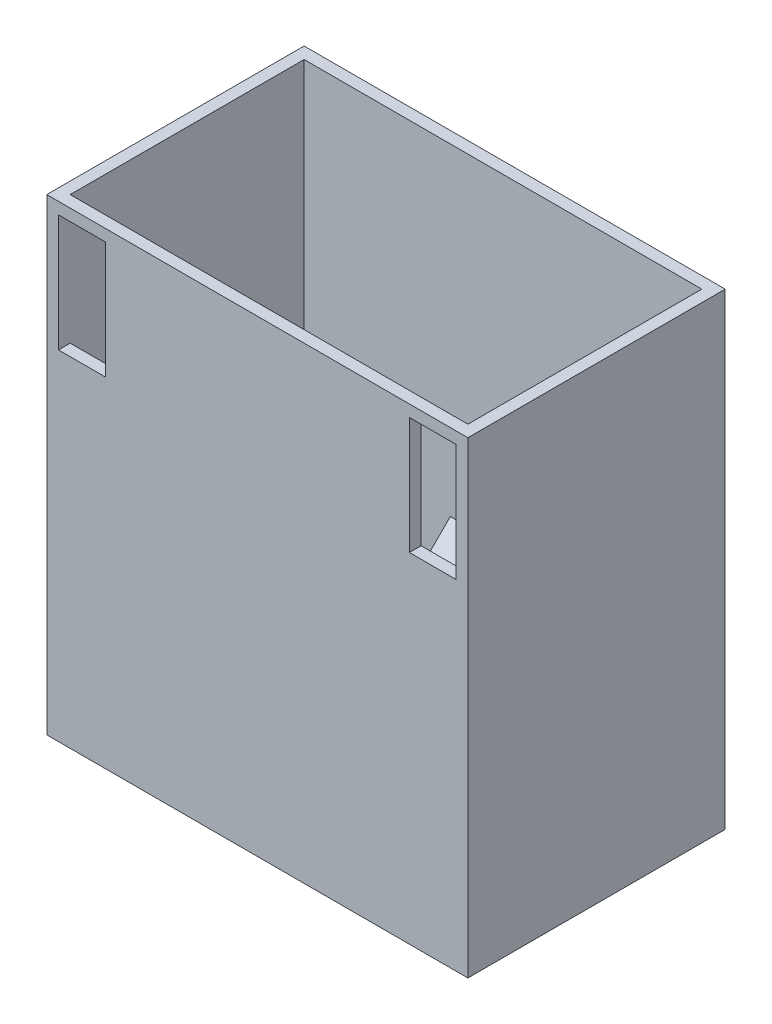
ISO-10303-21;
HEADER;
FILE_DESCRIPTION(('STEP AP214'),'2;1');
FILE_NAME('part.step','',(''),(''),'','','');
FILE_SCHEMA(('AUTOMOTIVE_DESIGN { 1 0 10303 214 1 1 1 1 }'));
ENDSEC;
DATA;
#1=APPLICATION_CONTEXT('core data for automotive mechanical design processes');
#2=APPLICATION_PROTOCOL_DEFINITION('international standard','automotive_design',2000,#1);
#3=PRODUCT_CONTEXT('',#1,'mechanical');
#4=PRODUCT('Part','Part','',(#3));
#5=PRODUCT_RELATED_PRODUCT_CATEGORY('part','',(#4));
#6=PRODUCT_DEFINITION_FORMATION('','',#4);
#7=PRODUCT_DEFINITION_CONTEXT('part definition',#1,'design');
#8=PRODUCT_DEFINITION('design','',#6,#7);
#9=PRODUCT_DEFINITION_SHAPE('','',#8);
#10=(LENGTH_UNIT() NAMED_UNIT(*) SI_UNIT(.MILLI.,.METRE.));
#11=(NAMED_UNIT(*) PLANE_ANGLE_UNIT() SI_UNIT($,.RADIAN.));
#12=(NAMED_UNIT(*) SI_UNIT($,.STERADIAN.) SOLID_ANGLE_UNIT());
#13=UNCERTAINTY_MEASURE_WITH_UNIT(LENGTH_MEASURE(1.E-05),#10,'distance_accuracy_value','');
#14=(GEOMETRIC_REPRESENTATION_CONTEXT(3) GLOBAL_UNCERTAINTY_ASSIGNED_CONTEXT((#13)) GLOBAL_UNIT_ASSIGNED_CONTEXT((#10,
#11,#12)) REPRESENTATION_CONTEXT('',''));
#15=CARTESIAN_POINT('',(0.,0.,0.));
#16=DIRECTION('',(0.,0.,1.));
#17=DIRECTION('',(1.,0.,0.));
#18=AXIS2_PLACEMENT_3D('',#15,#16,#17);
#19=CARTESIAN_POINT('',(0.,100.,0.));
#20=DIRECTION('',(1.,0.,0.));
#21=DIRECTION('',(0.,0.,-1.));
#22=AXIS2_PLACEMENT_3D('',#19,#20,#21);
#23=PLANE('',#22);
#24=DIRECTION('',(0.,0.,1.));
#25=VECTOR('',#24,1.);
#26=CARTESIAN_POINT('',(0.,0.,0.));
#27=LINE('',#26,#25);
#28=CARTESIAN_POINT('',(0.,0.,-55.));
#29=VERTEX_POINT('',#28);
#30=CARTESIAN_POINT('',(0.,0.,0.));
#31=VERTEX_POINT('',#30);
#32=EDGE_CURVE('E270',#29,#31,#27,.T.);
#33=ORIENTED_EDGE('',*,*,#32,.T.);
#34=DIRECTION('',(0.,-1.,0.));
#35=VECTOR('',#34,1.);
#36=CARTESIAN_POINT('',(0.,100.,0.));
#37=LINE('',#36,#35);
#38=CARTESIAN_POINT('',(0.,100.,0.));
#39=VERTEX_POINT('',#38);
#40=EDGE_CURVE('E297',#39,#31,#37,.T.);
#41=ORIENTED_EDGE('',*,*,#40,.F.);
#42=DIRECTION('',(0.,0.,1.));
#43=VECTOR('',#42,1.);
#44=CARTESIAN_POINT('',(0.,100.,0.));
#45=LINE('',#44,#43);
#46=CARTESIAN_POINT('',(0.,100.,-55.));
#47=VERTEX_POINT('',#46);
#48=EDGE_CURVE('E255',#47,#39,#45,.T.);
#49=ORIENTED_EDGE('',*,*,#48,.F.);
#50=DIRECTION('',(0.,-1.,0.));
#51=VECTOR('',#50,1.);
#52=CARTESIAN_POINT('',(0.,100.,-55.));
#53=LINE('',#52,#51);
#54=EDGE_CURVE('E269',#47,#29,#53,.T.);
#55=ORIENTED_EDGE('',*,*,#54,.T.);
#56=EDGE_LOOP('',(#33,#41,#49,#55));
#57=FACE_BOUND('',#56,.T.);
#58=ADVANCED_FACE('F55',(#57),#23,.F.);
#59=CARTESIAN_POINT('',(0.,100.,0.));
#60=DIRECTION('',(0.,0.,-1.));
#61=DIRECTION('',(-1.,0.,0.));
#62=AXIS2_PLACEMENT_3D('',#59,#60,#61);
#63=PLANE('',#62);
#64=DIRECTION('',(0.,-1.,0.));
#65=VECTOR('',#64,1.);
#66=CARTESIAN_POINT('',(77.5,97.5,0.));
#67=LINE('',#66,#65);
#68=CARTESIAN_POINT('',(77.5,97.5,0.));
#69=VERTEX_POINT('',#68);
#70=CARTESIAN_POINT('',(77.5,72.5,0.));
#71=VERTEX_POINT('',#70);
#72=EDGE_CURVE('E359',#69,#71,#67,.T.);
#73=ORIENTED_EDGE('',*,*,#72,.F.);
#74=DIRECTION('',(-1.,0.,0.));
#75=VECTOR('',#74,1.);
#76=CARTESIAN_POINT('',(87.5,97.5,0.));
#77=LINE('',#76,#75);
#78=CARTESIAN_POINT('',(87.5,97.5,0.));
#79=VERTEX_POINT('',#78);
#80=EDGE_CURVE('E628',#79,#69,#77,.T.);
#81=ORIENTED_EDGE('',*,*,#80,.F.);
#82=DIRECTION('',(0.,1.,0.));
#83=VECTOR('',#82,1.);
#84=CARTESIAN_POINT('',(87.5,97.5,0.));
#85=LINE('',#84,#83);
#86=CARTESIAN_POINT('',(87.5,72.5,0.));
#87=VERTEX_POINT('',#86);
#88=EDGE_CURVE('E625',#87,#79,#85,.T.);
#89=ORIENTED_EDGE('',*,*,#88,.F.);
#90=DIRECTION('',(1.,0.,0.));
#91=VECTOR('',#90,1.);
#92=CARTESIAN_POINT('',(87.5,72.5,0.));
#93=LINE('',#92,#91);
#94=EDGE_CURVE('E73',#71,#87,#93,.T.);
#95=ORIENTED_EDGE('',*,*,#94,.F.);
#96=EDGE_LOOP('',(#73,#81,#89,#95));
#97=FACE_BOUND('',#96,.T.);
#98=DIRECTION('',(0.,1.,0.));
#99=VECTOR('',#98,1.);
#100=CARTESIAN_POINT('',(12.5,97.5,0.));
#101=LINE('',#100,#99);
#102=CARTESIAN_POINT('',(12.5,72.5,0.));
#103=VERTEX_POINT('',#102);
#104=CARTESIAN_POINT('',(12.5,97.5,0.));
#105=VERTEX_POINT('',#104);
#106=EDGE_CURVE('E363',#103,#105,#101,.T.);
#107=ORIENTED_EDGE('',*,*,#106,.F.);
#108=DIRECTION('',(1.,0.,0.));
#109=VECTOR('',#108,1.);
#110=CARTESIAN_POINT('',(2.50000000000002,72.5,0.));
#111=LINE('',#110,#109);
#112=CARTESIAN_POINT('',(2.50000000000002,72.5,0.));
#113=VERTEX_POINT('',#112);
#114=EDGE_CURVE('E366',#113,#103,#111,.T.);
#115=ORIENTED_EDGE('',*,*,#114,.F.);
#116=DIRECTION('',(0.,-1.,0.));
#117=VECTOR('',#116,1.);
#118=CARTESIAN_POINT('',(2.5,97.5,0.));
#119=LINE('',#118,#117);
#120=CARTESIAN_POINT('',(2.5,97.5,0.));
#121=VERTEX_POINT('',#120);
#122=EDGE_CURVE('E372',#121,#113,#119,.T.);
#123=ORIENTED_EDGE('',*,*,#122,.F.);
#124=DIRECTION('',(-1.,0.,0.));
#125=VECTOR('',#124,1.);
#126=CARTESIAN_POINT('',(2.5,97.5,0.));
#127=LINE('',#126,#125);
#128=EDGE_CURVE('E81',#105,#121,#127,.T.);
#129=ORIENTED_EDGE('',*,*,#128,.F.);
#130=EDGE_LOOP('',(#107,#115,#123,#129));
#131=FACE_BOUND('',#130,.T.);
#132=DIRECTION('',(1.,0.,0.));
#133=VECTOR('',#132,1.);
#134=CARTESIAN_POINT('',(0.,0.,0.));
#135=LINE('',#134,#133);
#136=CARTESIAN_POINT('',(90.,0.,0.));
#137=VERTEX_POINT('',#136);
#138=EDGE_CURVE('E274',#31,#137,#135,.T.);
#139=ORIENTED_EDGE('',*,*,#138,.T.);
#140=DIRECTION('',(0.,-1.,0.));
#141=VECTOR('',#140,1.);
#142=CARTESIAN_POINT('',(90.,100.,0.));
#143=LINE('',#142,#141);
#144=CARTESIAN_POINT('',(90.,100.,0.));
#145=VERTEX_POINT('',#144);
#146=EDGE_CURVE('E301',#145,#137,#143,.T.);
#147=ORIENTED_EDGE('',*,*,#146,.F.);
#148=DIRECTION('',(1.,0.,0.));
#149=VECTOR('',#148,1.);
#150=CARTESIAN_POINT('',(0.,100.,0.));
#151=LINE('',#150,#149);
#152=EDGE_CURVE('E259',#39,#145,#151,.T.);
#153=ORIENTED_EDGE('',*,*,#152,.F.);
#154=ORIENTED_EDGE('',*,*,#40,.T.);
#155=EDGE_LOOP('',(#139,#147,#153,#154));
#156=FACE_BOUND('',#155,.T.);
#157=ADVANCED_FACE('F326',(#97,#131,#156),#63,.F.);
#158=CARTESIAN_POINT('',(90.,100.,0.));
#159=DIRECTION('',(-1.,0.,0.));
#160=DIRECTION('',(0.,0.,1.));
#161=AXIS2_PLACEMENT_3D('',#158,#159,#160);
#162=PLANE('',#161);
#163=DIRECTION('',(0.,0.,-1.));
#164=VECTOR('',#163,1.);
#165=CARTESIAN_POINT('',(90.,0.,0.));
#166=LINE('',#165,#164);
#167=CARTESIAN_POINT('',(90.,0.,-55.));
#168=VERTEX_POINT('',#167);
#169=EDGE_CURVE('E277',#137,#168,#166,.T.);
#170=ORIENTED_EDGE('',*,*,#169,.T.);
#171=DIRECTION('',(0.,-1.,0.));
#172=VECTOR('',#171,1.);
#173=CARTESIAN_POINT('',(90.,100.,-55.));
#174=LINE('',#173,#172);
#175=CARTESIAN_POINT('',(90.,100.,-55.));
#176=VERTEX_POINT('',#175);
#177=EDGE_CURVE('E304',#176,#168,#174,.T.);
#178=ORIENTED_EDGE('',*,*,#177,.F.);
#179=DIRECTION('',(0.,0.,-1.));
#180=VECTOR('',#179,1.);
#181=CARTESIAN_POINT('',(90.,100.,0.));
#182=LINE('',#181,#180);
#183=EDGE_CURVE('E263',#145,#176,#182,.T.);
#184=ORIENTED_EDGE('',*,*,#183,.F.);
#185=ORIENTED_EDGE('',*,*,#146,.T.);
#186=EDGE_LOOP('',(#170,#178,#184,#185));
#187=FACE_BOUND('',#186,.T.);
#188=ADVANCED_FACE('F333',(#187),#162,.F.);
#189=CARTESIAN_POINT('',(0.,100.,-55.));
#190=DIRECTION('',(0.,0.,1.));
#191=DIRECTION('',(1.,0.,0.));
#192=AXIS2_PLACEMENT_3D('',#189,#190,#191);
#193=PLANE('',#192);
#194=DIRECTION('',(-1.,0.,0.));
#195=VECTOR('',#194,1.);
#196=CARTESIAN_POINT('',(0.,0.,-55.));
#197=LINE('',#196,#195);
#198=CARTESIAN_POINT('',(53.75,0.,-55.));
#199=VERTEX_POINT('',#198);
#200=EDGE_CURVE('E260',#168,#199,#197,.T.);
#201=ORIENTED_EDGE('',*,*,#200,.T.);
#202=DIRECTION('',(0.,1.,0.));
#203=VECTOR('',#202,1.);
#204=CARTESIAN_POINT('',(53.75,0.,-55.));
#205=LINE('',#204,#203);
#206=CARTESIAN_POINT('',(53.75,30.,-55.));
#207=VERTEX_POINT('',#206);
#208=EDGE_CURVE('E442',#199,#207,#205,.T.);
#209=ORIENTED_EDGE('',*,*,#208,.T.);
#210=DIRECTION('',(1.,0.,0.));
#211=VECTOR('',#210,1.);
#212=CARTESIAN_POINT('',(53.75,30.,-55.));
#213=LINE('',#212,#211);
#214=CARTESIAN_POINT('',(36.25,30.,-55.));
#215=VERTEX_POINT('',#214);
#216=EDGE_CURVE('E449',#215,#207,#213,.T.);
#217=ORIENTED_EDGE('',*,*,#216,.F.);
#218=DIRECTION('',(0.,1.,0.));
#219=VECTOR('',#218,1.);
#220=CARTESIAN_POINT('',(36.25,0.,-55.));
#221=LINE('',#220,#219);
#222=CARTESIAN_POINT('',(36.25,0.,-55.));
#223=VERTEX_POINT('',#222);
#224=EDGE_CURVE('E496',#223,#215,#221,.T.);
#225=ORIENTED_EDGE('',*,*,#224,.F.);
#226=EDGE_CURVE('E280',#223,#29,#197,.T.);
#227=ORIENTED_EDGE('',*,*,#226,.T.);
#228=ORIENTED_EDGE('',*,*,#54,.F.);
#229=DIRECTION('',(-1.,0.,0.));
#230=VECTOR('',#229,1.);
#231=CARTESIAN_POINT('',(0.,100.,-55.));
#232=LINE('',#231,#230);
#233=EDGE_CURVE('E266',#176,#47,#232,.T.);
#234=ORIENTED_EDGE('',*,*,#233,.F.);
#235=ORIENTED_EDGE('',*,*,#177,.T.);
#236=EDGE_LOOP('',(#201,#209,#217,#225,#227,#228,#234,#235));
#237=FACE_BOUND('',#236,.T.);
#238=ADVANCED_FACE('F330',(#237),#193,.F.);
#239=CARTESIAN_POINT('',(0.,100.,0.));
#240=DIRECTION('',(0.,-1.,0.));
#241=DIRECTION('',(0.,0.,-1.));
#242=AXIS2_PLACEMENT_3D('',#239,#240,#241);
#243=PLANE('',#242);
#244=DIRECTION('',(1.,0.,0.));
#245=VECTOR('',#244,1.);
#246=CARTESIAN_POINT('',(2.5,100.,-2.5));
#247=LINE('',#246,#245);
#248=CARTESIAN_POINT('',(2.5,100.,-2.5));
#249=VERTEX_POINT('',#248);
#250=CARTESIAN_POINT('',(87.5,100.,-2.5));
#251=VERTEX_POINT('',#250);
#252=EDGE_CURVE('E557',#249,#251,#247,.T.);
#253=ORIENTED_EDGE('',*,*,#252,.F.);
#254=DIRECTION('',(0.,0.,1.));
#255=VECTOR('',#254,1.);
#256=CARTESIAN_POINT('',(2.5,100.,-2.5));
#257=LINE('',#256,#255);
#258=CARTESIAN_POINT('',(2.5,100.,-52.5));
#259=VERTEX_POINT('',#258);
#260=EDGE_CURVE('E539',#259,#249,#257,.T.);
#261=ORIENTED_EDGE('',*,*,#260,.F.);
#262=DIRECTION('',(-1.,0.,0.));
#263=VECTOR('',#262,1.);
#264=CARTESIAN_POINT('',(2.5,100.,-52.5));
#265=LINE('',#264,#263);
#266=CARTESIAN_POINT('',(87.5,100.,-52.5));
#267=VERTEX_POINT('',#266);
#268=EDGE_CURVE('E545',#267,#259,#265,.T.);
#269=ORIENTED_EDGE('',*,*,#268,.F.);
#270=DIRECTION('',(0.,0.,-1.));
#271=VECTOR('',#270,1.);
#272=CARTESIAN_POINT('',(87.5,100.,-2.5));
#273=LINE('',#272,#271);
#274=EDGE_CURVE('E561',#251,#267,#273,.T.);
#275=ORIENTED_EDGE('',*,*,#274,.F.);
#276=EDGE_LOOP('',(#253,#261,#269,#275));
#277=FACE_BOUND('',#276,.T.);
#278=ORIENTED_EDGE('',*,*,#48,.T.);
#279=ORIENTED_EDGE('',*,*,#152,.T.);
#280=ORIENTED_EDGE('',*,*,#183,.T.);
#281=ORIENTED_EDGE('',*,*,#233,.T.);
#282=EDGE_LOOP('',(#278,#279,#280,#281));
#283=FACE_BOUND('',#282,.T.);
#284=ADVANCED_FACE('F329',(#277,#283),#243,.F.);
#285=CARTESIAN_POINT('',(0.,0.,0.));
#286=DIRECTION('',(0.,-1.,0.));
#287=DIRECTION('',(0.,0.,-1.));
#288=AXIS2_PLACEMENT_3D('',#285,#286,#287);
#289=PLANE('',#288);
#290=DIRECTION('',(0.,0.,1.));
#291=VECTOR('',#290,1.);
#292=CARTESIAN_POINT('',(53.75,0.,-25.));
#293=LINE('',#292,#291);
#294=CARTESIAN_POINT('',(53.75,0.,-25.));
#295=VERTEX_POINT('',#294);
#296=EDGE_CURVE('E494',#199,#295,#293,.T.);
#297=ORIENTED_EDGE('',*,*,#296,.F.);
#298=ORIENTED_EDGE('',*,*,#200,.F.);
#299=ORIENTED_EDGE('',*,*,#169,.F.);
#300=ORIENTED_EDGE('',*,*,#138,.F.);
#301=ORIENTED_EDGE('',*,*,#32,.F.);
#302=ORIENTED_EDGE('',*,*,#226,.F.);
#303=DIRECTION('',(0.,0.,-1.));
#304=VECTOR('',#303,1.);
#305=CARTESIAN_POINT('',(36.25,0.,-25.));
#306=LINE('',#305,#304);
#307=CARTESIAN_POINT('',(36.25,0.,-25.));
#308=VERTEX_POINT('',#307);
#309=EDGE_CURVE('E443',#308,#223,#306,.T.);
#310=ORIENTED_EDGE('',*,*,#309,.F.);
#311=DIRECTION('',(-1.,0.,0.));
#312=VECTOR('',#311,1.);
#313=CARTESIAN_POINT('',(36.25,0.,-25.));
#314=LINE('',#313,#312);
#315=EDGE_CURVE('E387',#295,#308,#314,.T.);
#316=ORIENTED_EDGE('',*,*,#315,.F.);
#317=EDGE_LOOP('',(#297,#298,#299,#300,#301,#302,#310,#316));
#318=FACE_BOUND('',#317,.T.);
#319=ADVANCED_FACE('F321',(#318),#289,.T.);
#320=CARTESIAN_POINT('',(2.5,5.,-2.5));
#321=DIRECTION('',(-1.,0.,0.));
#322=DIRECTION('',(0.,0.,1.));
#323=AXIS2_PLACEMENT_3D('',#320,#321,#322);
#324=PLANE('',#323);
#325=ORIENTED_EDGE('',*,*,#260,.T.);
#326=DIRECTION('',(0.,1.,0.));
#327=VECTOR('',#326,1.);
#328=CARTESIAN_POINT('',(2.5,5.,-2.5));
#329=LINE('',#328,#327);
#330=CARTESIAN_POINT('',(2.5,97.5,-2.5));
#331=VERTEX_POINT('',#330);
#332=EDGE_CURVE('E254',#331,#249,#329,.T.);
#333=ORIENTED_EDGE('',*,*,#332,.F.);
#334=DIRECTION('',(0.,0.,1.));
#335=VECTOR('',#334,1.);
#336=CARTESIAN_POINT('',(2.5,97.5,-55.0011));
#337=LINE('',#336,#335);
#338=EDGE_CURVE('E603',#331,#121,#337,.T.);
#339=ORIENTED_EDGE('',*,*,#338,.T.);
#340=ORIENTED_EDGE('',*,*,#122,.T.);
#341=DIRECTION('',(0.,0.,1.));
#342=VECTOR('',#341,1.);
#343=CARTESIAN_POINT('',(2.50000000000002,72.5,-55.0011));
#344=LINE('',#343,#342);
#345=CARTESIAN_POINT('',(2.5,72.5,-2.5));
#346=VERTEX_POINT('',#345);
#347=EDGE_CURVE('E600',#346,#113,#344,.T.);
#348=ORIENTED_EDGE('',*,*,#347,.F.);
#349=CARTESIAN_POINT('',(2.5,5.,-2.5));
#350=VERTEX_POINT('',#349);
#351=EDGE_CURVE('E248',#350,#346,#329,.T.);
#352=ORIENTED_EDGE('',*,*,#351,.F.);
#353=DIRECTION('',(0.,0.,1.));
#354=VECTOR('',#353,1.);
#355=CARTESIAN_POINT('',(2.5,5.,-2.5));
#356=LINE('',#355,#354);
#357=CARTESIAN_POINT('',(2.5,5.,-52.5));
#358=VERTEX_POINT('',#357);
#359=EDGE_CURVE('E540',#358,#350,#356,.T.);
#360=ORIENTED_EDGE('',*,*,#359,.F.);
#361=DIRECTION('',(0.,1.,0.));
#362=VECTOR('',#361,1.);
#363=CARTESIAN_POINT('',(2.5,5.,-52.5));
#364=LINE('',#363,#362);
#365=EDGE_CURVE('E246',#358,#259,#364,.T.);
#366=ORIENTED_EDGE('',*,*,#365,.T.);
#367=EDGE_LOOP('',(#325,#333,#339,#340,#348,#352,#360,#366));
#368=FACE_BOUND('',#367,.T.);
#369=ADVANCED_FACE('F570',(#368),#324,.F.);
#370=CARTESIAN_POINT('',(2.5,5.,-52.5));
#371=DIRECTION('',(0.,0.,-1.));
#372=DIRECTION('',(-1.,0.,0.));
#373=AXIS2_PLACEMENT_3D('',#370,#371,#372);
#374=PLANE('',#373);
#375=DIRECTION('',(-1.,0.,0.));
#376=VECTOR('',#375,1.);
#377=CARTESIAN_POINT('',(2.5,5.,-52.5));
#378=LINE('',#377,#376);
#379=CARTESIAN_POINT('',(33.75,5.,-52.5));
#380=VERTEX_POINT('',#379);
#381=EDGE_CURVE('E550',#380,#358,#378,.T.);
#382=ORIENTED_EDGE('',*,*,#381,.F.);
#383=DIRECTION('',(0.,1.,0.));
#384=VECTOR('',#383,1.);
#385=CARTESIAN_POINT('',(33.75,5.,-52.5));
#386=LINE('',#385,#384);
#387=CARTESIAN_POINT('',(33.75,31.0355339059328,-52.5));
#388=VERTEX_POINT('',#387);
#389=EDGE_CURVE('E533',#380,#388,#386,.T.);
#390=ORIENTED_EDGE('',*,*,#389,.T.);
#391=DIRECTION('',(1.,0.,0.));
#392=VECTOR('',#391,1.);
#393=CARTESIAN_POINT('',(2.50000000000001,31.0355339059328,-52.5));
#394=LINE('',#393,#392);
#395=CARTESIAN_POINT('',(56.25,31.0355339059328,-52.5));
#396=VERTEX_POINT('',#395);
#397=EDGE_CURVE('E536',#388,#396,#394,.T.);
#398=ORIENTED_EDGE('',*,*,#397,.T.);
#399=DIRECTION('',(0.,1.,0.));
#400=VECTOR('',#399,1.);
#401=CARTESIAN_POINT('',(56.25,5.,-52.5));
#402=LINE('',#401,#400);
#403=CARTESIAN_POINT('',(56.25,5.,-52.5));
#404=VERTEX_POINT('',#403);
#405=EDGE_CURVE('E528',#404,#396,#402,.T.);
#406=ORIENTED_EDGE('',*,*,#405,.F.);
#407=CARTESIAN_POINT('',(87.5,5.,-52.5));
#408=VERTEX_POINT('',#407);
#409=EDGE_CURVE('E551',#408,#404,#378,.T.);
#410=ORIENTED_EDGE('',*,*,#409,.F.);
#411=DIRECTION('',(0.,1.,0.));
#412=VECTOR('',#411,1.);
#413=CARTESIAN_POINT('',(87.5,5.,-52.5));
#414=LINE('',#413,#412);
#415=EDGE_CURVE('E241',#408,#267,#414,.T.);
#416=ORIENTED_EDGE('',*,*,#415,.T.);
#417=ORIENTED_EDGE('',*,*,#268,.T.);
#418=ORIENTED_EDGE('',*,*,#365,.F.);
#419=EDGE_LOOP('',(#382,#390,#398,#406,#410,#416,#417,#418));
#420=FACE_BOUND('',#419,.T.);
#421=ADVANCED_FACE('F577',(#420),#374,.F.);
#422=CARTESIAN_POINT('',(87.5,5.,-2.5));
#423=DIRECTION('',(1.,0.,0.));
#424=DIRECTION('',(0.,0.,-1.));
#425=AXIS2_PLACEMENT_3D('',#422,#423,#424);
#426=PLANE('',#425);
#427=ORIENTED_EDGE('',*,*,#274,.T.);
#428=ORIENTED_EDGE('',*,*,#415,.F.);
#429=DIRECTION('',(0.,0.,-1.));
#430=VECTOR('',#429,1.);
#431=CARTESIAN_POINT('',(87.5,5.,-2.5));
#432=LINE('',#431,#430);
#433=CARTESIAN_POINT('',(87.5,5.,-2.5));
#434=VERTEX_POINT('',#433);
#435=EDGE_CURVE('E238',#434,#408,#432,.T.);
#436=ORIENTED_EDGE('',*,*,#435,.F.);
#437=DIRECTION('',(0.,1.,0.));
#438=VECTOR('',#437,1.);
#439=CARTESIAN_POINT('',(87.5,5.,-2.5));
#440=LINE('',#439,#438);
#441=CARTESIAN_POINT('',(87.5,72.5,-2.5));
#442=VERTEX_POINT('',#441);
#443=EDGE_CURVE('E227',#434,#442,#440,.T.);
#444=ORIENTED_EDGE('',*,*,#443,.T.);
#445=DIRECTION('',(0.,0.,1.));
#446=VECTOR('',#445,1.);
#447=CARTESIAN_POINT('',(87.5,72.5,-55.0011));
#448=LINE('',#447,#446);
#449=EDGE_CURVE('E210',#442,#87,#448,.T.);
#450=ORIENTED_EDGE('',*,*,#449,.T.);
#451=ORIENTED_EDGE('',*,*,#88,.T.);
#452=DIRECTION('',(0.,0.,1.));
#453=VECTOR('',#452,1.);
#454=CARTESIAN_POINT('',(87.5,97.5,-55.0011));
#455=LINE('',#454,#453);
#456=CARTESIAN_POINT('',(87.5,97.5,-2.5));
#457=VERTEX_POINT('',#456);
#458=EDGE_CURVE('E220',#457,#79,#455,.T.);
#459=ORIENTED_EDGE('',*,*,#458,.F.);
#460=EDGE_CURVE('E242',#457,#251,#440,.T.);
#461=ORIENTED_EDGE('',*,*,#460,.T.);
#462=EDGE_LOOP('',(#427,#428,#436,#444,#450,#451,#459,#461));
#463=FACE_BOUND('',#462,.T.);
#464=ADVANCED_FACE('F236',(#463),#426,.F.);
#465=CARTESIAN_POINT('',(2.5,5.,-2.5));
#466=DIRECTION('',(0.,0.,1.));
#467=DIRECTION('',(1.,0.,0.));
#468=AXIS2_PLACEMENT_3D('',#465,#466,#467);
#469=PLANE('',#468);
#470=ORIENTED_EDGE('',*,*,#460,.F.);
#471=DIRECTION('',(1.,0.,0.));
#472=VECTOR('',#471,1.);
#473=CARTESIAN_POINT('',(87.5,97.5,-2.5));
#474=LINE('',#473,#472);
#475=CARTESIAN_POINT('',(77.5,97.5,-2.5));
#476=VERTEX_POINT('',#475);
#477=EDGE_CURVE('E622',#476,#457,#474,.T.);
#478=ORIENTED_EDGE('',*,*,#477,.F.);
#479=DIRECTION('',(0.,1.,0.));
#480=VECTOR('',#479,1.);
#481=CARTESIAN_POINT('',(77.5,97.5,-2.5));
#482=LINE('',#481,#480);
#483=CARTESIAN_POINT('',(77.5,72.5,-2.5));
#484=VERTEX_POINT('',#483);
#485=EDGE_CURVE('E231',#484,#476,#482,.T.);
#486=ORIENTED_EDGE('',*,*,#485,.F.);
#487=DIRECTION('',(-1.,0.,0.));
#488=VECTOR('',#487,1.);
#489=CARTESIAN_POINT('',(87.5,72.5,-2.5));
#490=LINE('',#489,#488);
#491=EDGE_CURVE('E213',#442,#484,#490,.T.);
#492=ORIENTED_EDGE('',*,*,#491,.F.);
#493=ORIENTED_EDGE('',*,*,#443,.F.);
#494=DIRECTION('',(1.,0.,0.));
#495=VECTOR('',#494,1.);
#496=CARTESIAN_POINT('',(2.5,5.,-2.5));
#497=LINE('',#496,#495);
#498=EDGE_CURVE('E544',#350,#434,#497,.T.);
#499=ORIENTED_EDGE('',*,*,#498,.F.);
#500=ORIENTED_EDGE('',*,*,#351,.T.);
#501=DIRECTION('',(-1.,0.,0.));
#502=VECTOR('',#501,1.);
#503=CARTESIAN_POINT('',(2.50000000000002,72.5,-2.5));
#504=LINE('',#503,#502);
#505=CARTESIAN_POINT('',(12.5,72.5,-2.5));
#506=VERTEX_POINT('',#505);
#507=EDGE_CURVE('E378',#506,#346,#504,.T.);
#508=ORIENTED_EDGE('',*,*,#507,.F.);
#509=DIRECTION('',(0.,-1.,0.));
#510=VECTOR('',#509,1.);
#511=CARTESIAN_POINT('',(12.5,97.5,-2.5));
#512=LINE('',#511,#510);
#513=CARTESIAN_POINT('',(12.5,97.5,-2.5));
#514=VERTEX_POINT('',#513);
#515=EDGE_CURVE('E381',#514,#506,#512,.T.);
#516=ORIENTED_EDGE('',*,*,#515,.F.);
#517=DIRECTION('',(1.,0.,0.));
#518=VECTOR('',#517,1.);
#519=CARTESIAN_POINT('',(2.5,97.5,-2.5));
#520=LINE('',#519,#518);
#521=EDGE_CURVE('E233',#331,#514,#520,.T.);
#522=ORIENTED_EDGE('',*,*,#521,.F.);
#523=ORIENTED_EDGE('',*,*,#332,.T.);
#524=ORIENTED_EDGE('',*,*,#252,.T.);
#525=EDGE_LOOP('',(#470,#478,#486,#492,#493,#499,#500,#508,#516,#522,#523,#524));
#526=FACE_BOUND('',#525,.T.);
#527=ADVANCED_FACE('F225',(#526),#469,.F.);
#528=CARTESIAN_POINT('',(0.,5.,0.));
#529=DIRECTION('',(0.,-1.,0.));
#530=DIRECTION('',(0.,0.,-1.));
#531=AXIS2_PLACEMENT_3D('',#528,#529,#530);
#532=PLANE('',#531);
#533=DIRECTION('',(-1.,0.,0.));
#534=VECTOR('',#533,1.);
#535=CARTESIAN_POINT('',(0.,5.,-26.4644660940672));
#536=LINE('',#535,#534);
#537=CARTESIAN_POINT('',(56.25,5.,-26.4644660940672));
#538=VERTEX_POINT('',#537);
#539=CARTESIAN_POINT('',(33.75,5.,-26.4644660940672));
#540=VERTEX_POINT('',#539);
#541=EDGE_CURVE('E65',#538,#540,#536,.T.);
#542=ORIENTED_EDGE('',*,*,#541,.T.);
#543=DIRECTION('',(0.,0.,-1.));
#544=VECTOR('',#543,1.);
#545=CARTESIAN_POINT('',(33.75,5.,0.));
#546=LINE('',#545,#544);
#547=EDGE_CURVE('E12',#540,#380,#546,.T.);
#548=ORIENTED_EDGE('',*,*,#547,.T.);
#549=ORIENTED_EDGE('',*,*,#381,.T.);
#550=ORIENTED_EDGE('',*,*,#359,.T.);
#551=ORIENTED_EDGE('',*,*,#498,.T.);
#552=ORIENTED_EDGE('',*,*,#435,.T.);
#553=ORIENTED_EDGE('',*,*,#409,.T.);
#554=DIRECTION('',(0.,0.,-1.));
#555=VECTOR('',#554,1.);
#556=CARTESIAN_POINT('',(56.25,5.,0.));
#557=LINE('',#556,#555);
#558=EDGE_CURVE('E293',#538,#404,#557,.T.);
#559=ORIENTED_EDGE('',*,*,#558,.F.);
#560=EDGE_LOOP('',(#542,#548,#549,#550,#551,#552,#553,#559));
#561=FACE_BOUND('',#560,.T.);
#562=ADVANCED_FACE('F586',(#561),#532,.F.);
#563=CARTESIAN_POINT('',(33.75,0.,-21.4644660940672));
#564=DIRECTION('',(0.,0.707106781186548,0.707106781186548));
#565=DIRECTION('',(0.,-0.707106781186548,0.707106781186548));
#566=AXIS2_PLACEMENT_3D('',#563,#564,#565);
#567=PLANE('',#566);
#568=ORIENTED_EDGE('',*,*,#397,.F.);
#569=DIRECTION('',(0.,-0.707106781186548,0.707106781186548));
#570=VECTOR('',#569,1.);
#571=CARTESIAN_POINT('',(33.75,0.,-21.4644660940672));
#572=LINE('',#571,#570);
#573=EDGE_CURVE('E522',#388,#540,#572,.T.);
#574=ORIENTED_EDGE('',*,*,#573,.T.);
#575=ORIENTED_EDGE('',*,*,#541,.F.);
#576=DIRECTION('',(0.,-0.707106781186548,0.707106781186548));
#577=VECTOR('',#576,1.);
#578=CARTESIAN_POINT('',(56.25,0.,-21.4644660940672));
#579=LINE('',#578,#577);
#580=EDGE_CURVE('E519',#396,#538,#579,.T.);
#581=ORIENTED_EDGE('',*,*,#580,.F.);
#582=EDGE_LOOP('',(#568,#574,#575,#581));
#583=FACE_BOUND('',#582,.T.);
#584=ADVANCED_FACE('F595',(#583),#567,.T.);
#585=CARTESIAN_POINT('',(33.75,0.,0.));
#586=DIRECTION('',(-1.,0.,0.));
#587=DIRECTION('',(0.,0.,1.));
#588=AXIS2_PLACEMENT_3D('',#585,#586,#587);
#589=PLANE('',#588);
#590=ORIENTED_EDGE('',*,*,#389,.F.);
#591=ORIENTED_EDGE('',*,*,#547,.F.);
#592=ORIENTED_EDGE('',*,*,#573,.F.);
#593=EDGE_LOOP('',(#590,#591,#592));
#594=FACE_BOUND('',#593,.T.);
#595=ADVANCED_FACE('F592',(#594),#589,.T.);
#596=CARTESIAN_POINT('',(56.25,0.,0.));
#597=DIRECTION('',(-1.,0.,0.));
#598=DIRECTION('',(0.,0.,1.));
#599=AXIS2_PLACEMENT_3D('',#596,#597,#598);
#600=PLANE('',#599);
#601=ORIENTED_EDGE('',*,*,#558,.T.);
#602=ORIENTED_EDGE('',*,*,#405,.T.);
#603=ORIENTED_EDGE('',*,*,#580,.T.);
#604=EDGE_LOOP('',(#601,#602,#603));
#605=FACE_BOUND('',#604,.T.);
#606=ADVANCED_FACE('F471',(#605),#600,.F.);
#607=CARTESIAN_POINT('',(0.,30.,0.));
#608=DIRECTION('',(0.,-1.,0.));
#609=DIRECTION('',(1.,0.,0.));
#610=AXIS2_PLACEMENT_3D('',#607,#608,#609);
#611=PLANE('',#610);
#612=DIRECTION('',(0.,0.,1.));
#613=VECTOR('',#612,1.);
#614=CARTESIAN_POINT('',(53.75,30.,-55.));
#615=LINE('',#614,#613);
#616=CARTESIAN_POINT('',(53.75,30.,-52.5));
#617=VERTEX_POINT('',#616);
#618=EDGE_CURVE('E58',#207,#617,#615,.T.);
#619=ORIENTED_EDGE('',*,*,#618,.T.);
#620=DIRECTION('',(-1.,0.,0.));
#621=VECTOR('',#620,1.);
#622=CARTESIAN_POINT('',(53.75,30.,-52.5));
#623=LINE('',#622,#621);
#624=CARTESIAN_POINT('',(36.25,30.,-52.5));
#625=VERTEX_POINT('',#624);
#626=EDGE_CURVE('E450',#617,#625,#623,.T.);
#627=ORIENTED_EDGE('',*,*,#626,.T.);
#628=DIRECTION('',(0.,0.,-1.));
#629=VECTOR('',#628,1.);
#630=CARTESIAN_POINT('',(36.25,30.,-55.));
#631=LINE('',#630,#629);
#632=EDGE_CURVE('E446',#625,#215,#631,.T.);
#633=ORIENTED_EDGE('',*,*,#632,.T.);
#634=ORIENTED_EDGE('',*,*,#216,.T.);
#635=EDGE_LOOP('',(#619,#627,#633,#634));
#636=FACE_BOUND('',#635,.T.);
#637=ADVANCED_FACE('F462',(#636),#611,.T.);
#638=CARTESIAN_POINT('',(53.75,0.,0.));
#639=DIRECTION('',(1.,0.,0.));
#640=DIRECTION('',(0.,1.,0.));
#641=AXIS2_PLACEMENT_3D('',#638,#639,#640);
#642=PLANE('',#641);
#643=ORIENTED_EDGE('',*,*,#208,.F.);
#644=ORIENTED_EDGE('',*,*,#296,.T.);
#645=DIRECTION('',(0.,0.737154140200741,-0.675724628517346));
#646=VECTOR('',#645,1.);
#647=CARTESIAN_POINT('',(53.75,0.,-25.));
#648=LINE('',#647,#646);
#649=EDGE_CURVE('E392',#295,#617,#648,.T.);
#650=ORIENTED_EDGE('',*,*,#649,.T.);
#651=ORIENTED_EDGE('',*,*,#618,.F.);
#652=EDGE_LOOP('',(#643,#644,#650,#651));
#653=FACE_BOUND('',#652,.T.);
#654=ADVANCED_FACE('F405',(#653),#642,.F.);
#655=CARTESIAN_POINT('',(0.,-12.4528301886792,-13.5849056603774));
#656=DIRECTION('',(0.,0.675724628517346,0.737154140200741));
#657=DIRECTION('',(0.,-0.737154140200741,0.675724628517346));
#658=AXIS2_PLACEMENT_3D('',#655,#656,#657);
#659=PLANE('',#658);
#660=ORIENTED_EDGE('',*,*,#649,.F.);
#661=ORIENTED_EDGE('',*,*,#315,.T.);
#662=DIRECTION('',(0.,0.737154140200741,-0.675724628517346));
#663=VECTOR('',#662,1.);
#664=CARTESIAN_POINT('',(36.25,0.,-25.));
#665=LINE('',#664,#663);
#666=EDGE_CURVE('E492',#308,#625,#665,.T.);
#667=ORIENTED_EDGE('',*,*,#666,.T.);
#668=ORIENTED_EDGE('',*,*,#626,.F.);
#669=EDGE_LOOP('',(#660,#661,#667,#668));
#670=FACE_BOUND('',#669,.T.);
#671=ADVANCED_FACE('F394',(#670),#659,.F.);
#672=CARTESIAN_POINT('',(36.25,0.,0.));
#673=DIRECTION('',(-1.,0.,0.));
#674=DIRECTION('',(0.,-1.,0.));
#675=AXIS2_PLACEMENT_3D('',#672,#673,#674);
#676=PLANE('',#675);
#677=ORIENTED_EDGE('',*,*,#666,.F.);
#678=ORIENTED_EDGE('',*,*,#309,.T.);
#679=ORIENTED_EDGE('',*,*,#224,.T.);
#680=ORIENTED_EDGE('',*,*,#632,.F.);
#681=EDGE_LOOP('',(#677,#678,#679,#680));
#682=FACE_BOUND('',#681,.T.);
#683=ADVANCED_FACE('F404',(#682),#676,.F.);
#684=CARTESIAN_POINT('',(2.50000000000002,72.5,-55.0011));
#685=DIRECTION('',(0.,-1.,0.));
#686=DIRECTION('',(0.,0.,-1.));
#687=AXIS2_PLACEMENT_3D('',#684,#685,#686);
#688=PLANE('',#687);
#689=ORIENTED_EDGE('',*,*,#507,.T.);
#690=ORIENTED_EDGE('',*,*,#347,.T.);
#691=ORIENTED_EDGE('',*,*,#114,.T.);
#692=DIRECTION('',(0.,0.,1.));
#693=VECTOR('',#692,1.);
#694=CARTESIAN_POINT('',(12.5,72.5,-55.0011));
#695=LINE('',#694,#693);
#696=EDGE_CURVE('E374',#506,#103,#695,.T.);
#697=ORIENTED_EDGE('',*,*,#696,.F.);
#698=EDGE_LOOP('',(#689,#690,#691,#697));
#699=FACE_BOUND('',#698,.T.);
#700=ADVANCED_FACE('F703',(#699),#688,.F.);
#701=CARTESIAN_POINT('',(12.5,97.5,-55.0011));
#702=DIRECTION('',(1.,0.,0.));
#703=DIRECTION('',(0.,0.,-1.));
#704=AXIS2_PLACEMENT_3D('',#701,#702,#703);
#705=PLANE('',#704);
#706=ORIENTED_EDGE('',*,*,#515,.T.);
#707=ORIENTED_EDGE('',*,*,#696,.T.);
#708=ORIENTED_EDGE('',*,*,#106,.T.);
#709=DIRECTION('',(0.,0.,1.));
#710=VECTOR('',#709,1.);
#711=CARTESIAN_POINT('',(12.5,97.5,-55.0011));
#712=LINE('',#711,#710);
#713=EDGE_CURVE('E606',#514,#105,#712,.T.);
#714=ORIENTED_EDGE('',*,*,#713,.F.);
#715=EDGE_LOOP('',(#706,#707,#708,#714));
#716=FACE_BOUND('',#715,.T.);
#717=ADVANCED_FACE('F730',(#716),#705,.F.);
#718=CARTESIAN_POINT('',(2.5,97.5,-55.0011));
#719=DIRECTION('',(0.,1.,0.));
#720=DIRECTION('',(0.,0.,1.));
#721=AXIS2_PLACEMENT_3D('',#718,#719,#720);
#722=PLANE('',#721);
#723=ORIENTED_EDGE('',*,*,#521,.T.);
#724=ORIENTED_EDGE('',*,*,#713,.T.);
#725=ORIENTED_EDGE('',*,*,#128,.T.);
#726=ORIENTED_EDGE('',*,*,#338,.F.);
#727=EDGE_LOOP('',(#723,#724,#725,#726));
#728=FACE_BOUND('',#727,.T.);
#729=ADVANCED_FACE('F739',(#728),#722,.F.);
#730=CARTESIAN_POINT('',(87.5,97.5,-55.0011));
#731=DIRECTION('',(0.,1.,0.));
#732=DIRECTION('',(0.,0.,1.));
#733=AXIS2_PLACEMENT_3D('',#730,#731,#732);
#734=PLANE('',#733);
#735=ORIENTED_EDGE('',*,*,#477,.T.);
#736=ORIENTED_EDGE('',*,*,#458,.T.);
#737=ORIENTED_EDGE('',*,*,#80,.T.);
#738=DIRECTION('',(0.,0.,1.));
#739=VECTOR('',#738,1.);
#740=CARTESIAN_POINT('',(77.5,97.5,-55.0011));
#741=LINE('',#740,#739);
#742=EDGE_CURVE('E636',#476,#69,#741,.T.);
#743=ORIENTED_EDGE('',*,*,#742,.F.);
#744=EDGE_LOOP('',(#735,#736,#737,#743));
#745=FACE_BOUND('',#744,.T.);
#746=ADVANCED_FACE('F748',(#745),#734,.F.);
#747=CARTESIAN_POINT('',(77.5,97.5,-55.0011));
#748=DIRECTION('',(-1.,0.,0.));
#749=DIRECTION('',(0.,0.,1.));
#750=AXIS2_PLACEMENT_3D('',#747,#748,#749);
#751=PLANE('',#750);
#752=ORIENTED_EDGE('',*,*,#485,.T.);
#753=ORIENTED_EDGE('',*,*,#742,.T.);
#754=ORIENTED_EDGE('',*,*,#72,.T.);
#755=DIRECTION('',(0.,0.,1.));
#756=VECTOR('',#755,1.);
#757=CARTESIAN_POINT('',(77.5,72.5,-55.0011));
#758=LINE('',#757,#756);
#759=EDGE_CURVE('E221',#484,#71,#758,.T.);
#760=ORIENTED_EDGE('',*,*,#759,.F.);
#761=EDGE_LOOP('',(#752,#753,#754,#760));
#762=FACE_BOUND('',#761,.T.);
#763=ADVANCED_FACE('F756',(#762),#751,.F.);
#764=CARTESIAN_POINT('',(87.5,72.5,-55.0011));
#765=DIRECTION('',(0.,-1.,0.));
#766=DIRECTION('',(0.,0.,-1.));
#767=AXIS2_PLACEMENT_3D('',#764,#765,#766);
#768=PLANE('',#767);
#769=ORIENTED_EDGE('',*,*,#491,.T.);
#770=ORIENTED_EDGE('',*,*,#759,.T.);
#771=ORIENTED_EDGE('',*,*,#94,.T.);
#772=ORIENTED_EDGE('',*,*,#449,.F.);
#773=EDGE_LOOP('',(#769,#770,#771,#772));
#774=FACE_BOUND('',#773,.T.);
#775=ADVANCED_FACE('F212',(#774),#768,.F.);
#776=CLOSED_SHELL('',(#58,#157,#188,#238,#284,#319,#369,#421,#464,#527,#562,#584,#595,#606,#637,
#654,#671,#683,#700,#717,#729,#746,#763,#775));
#777=MANIFOLD_SOLID_BREP('B2',#776);
#778=ADVANCED_BREP_SHAPE_REPRESENTATION('',(#18,#777),#14);
#779=SHAPE_DEFINITION_REPRESENTATION(#9,#778);
ENDSEC;
END-ISO-10303-21;
